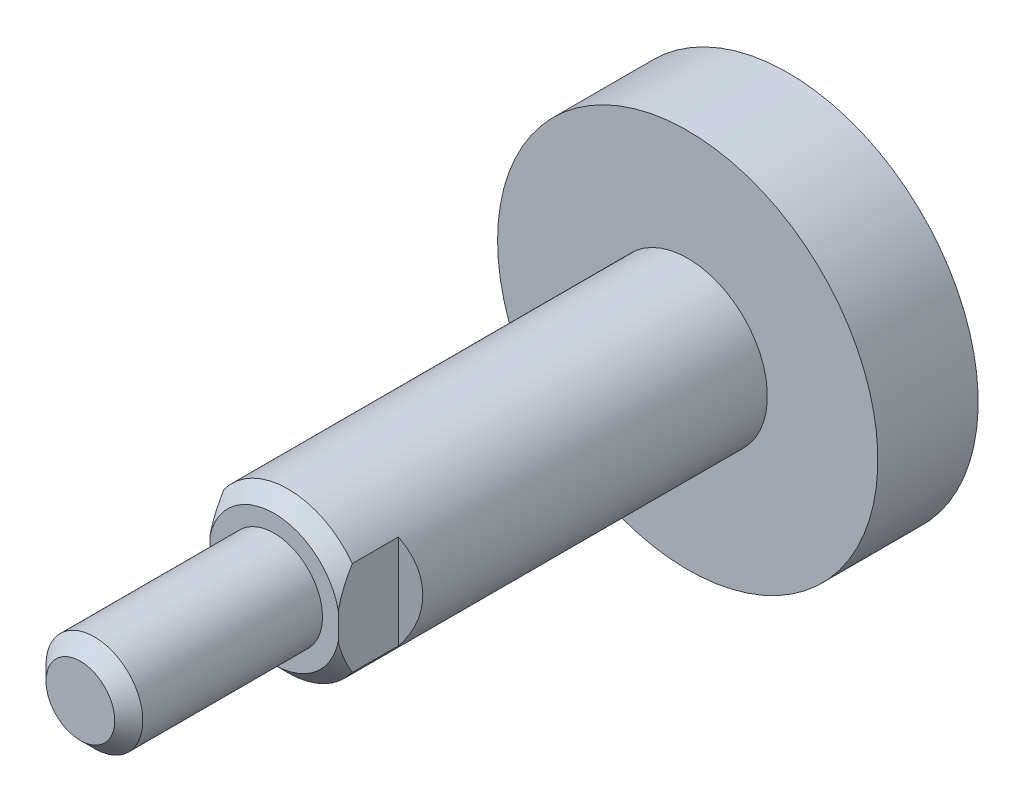
ISO-10303-21;
HEADER;
FILE_DESCRIPTION(('STEP AP214'),'2;1');
FILE_NAME('part.step','',(''),(''),'','','');
FILE_SCHEMA(('AUTOMOTIVE_DESIGN { 1 0 10303 214 1 1 1 1 }'));
ENDSEC;
DATA;
#1=APPLICATION_CONTEXT('core data for automotive mechanical design processes');
#2=APPLICATION_PROTOCOL_DEFINITION('international standard','automotive_design',2000,#1);
#3=PRODUCT_CONTEXT('',#1,'mechanical');
#4=PRODUCT('Part','Part','',(#3));
#5=PRODUCT_RELATED_PRODUCT_CATEGORY('part','',(#4));
#6=PRODUCT_DEFINITION_FORMATION('','',#4);
#7=PRODUCT_DEFINITION_CONTEXT('part definition',#1,'design');
#8=PRODUCT_DEFINITION('design','',#6,#7);
#9=PRODUCT_DEFINITION_SHAPE('','',#8);
#10=(LENGTH_UNIT() NAMED_UNIT(*) SI_UNIT(.MILLI.,.METRE.));
#11=(NAMED_UNIT(*) PLANE_ANGLE_UNIT() SI_UNIT($,.RADIAN.));
#12=(NAMED_UNIT(*) SI_UNIT($,.STERADIAN.) SOLID_ANGLE_UNIT());
#13=UNCERTAINTY_MEASURE_WITH_UNIT(LENGTH_MEASURE(1.E-05),#10,'distance_accuracy_value','');
#14=(GEOMETRIC_REPRESENTATION_CONTEXT(3) GLOBAL_UNCERTAINTY_ASSIGNED_CONTEXT((#13)) GLOBAL_UNIT_ASSIGNED_CONTEXT((#10,
#11,#12)) REPRESENTATION_CONTEXT('',''));
#15=CARTESIAN_POINT('',(0.,0.,0.));
#16=DIRECTION('',(0.,0.,1.));
#17=DIRECTION('',(1.,0.,0.));
#18=AXIS2_PLACEMENT_3D('',#15,#16,#17);
#19=CARTESIAN_POINT('',(0.,0.,35.266));
#20=DIRECTION('',(0.,0.,1.));
#21=DIRECTION('',(1.,0.,0.));
#22=AXIS2_PLACEMENT_3D('',#19,#20,#21);
#23=PLANE('',#22);
#24=CARTESIAN_POINT('',(0.,0.,35.2659999999219));
#25=DIRECTION('',(0.,0.,-1.));
#26=DIRECTION('',(-1.,0.,0.));
#27=AXIS2_PLACEMENT_3D('',#24,#25,#26);
#28=CIRCLE('',#27,1.71299999999519);
#29=CARTESIAN_POINT('',(-1.71299999999519,0.,35.2659999999219));
#30=VERTEX_POINT('',#29);
#31=EDGE_CURVE('E19',#30,#30,#28,.T.);
#32=ORIENTED_EDGE('',*,*,#31,.F.);
#33=EDGE_LOOP('',(#32));
#34=FACE_BOUND('',#33,.T.);
#35=ADVANCED_FACE('F16',(#34),#23,.T.);
#36=CARTESIAN_POINT('',(0.,0.,34.5659999999839));
#37=DIRECTION('',(0.,0.,-1.));
#38=DIRECTION('',(-1.,0.,0.));
#39=AXIS2_PLACEMENT_3D('',#36,#37,#38);
#40=CONICAL_SURFACE('',#39,2.41299999993316,0.785398163397448);
#41=ORIENTED_EDGE('',*,*,#31,.T.);
#42=EDGE_LOOP('',(#41));
#43=FACE_BOUND('',#42,.T.);
#44=CARTESIAN_POINT('',(0.,0.,34.566));
#45=DIRECTION('',(0.,0.,-1.));
#46=DIRECTION('',(-1.,0.,0.));
#47=AXIS2_PLACEMENT_3D('',#44,#45,#46);
#48=CIRCLE('',#47,2.413);
#49=CARTESIAN_POINT('',(-2.413,0.,34.566));
#50=VERTEX_POINT('',#49);
#51=EDGE_CURVE('E71',#50,#50,#48,.T.);
#52=ORIENTED_EDGE('',*,*,#51,.F.);
#53=EDGE_LOOP('',(#52));
#54=FACE_BOUND('',#53,.T.);
#55=ADVANCED_FACE('F196',(#43,#54),#40,.T.);
#56=CARTESIAN_POINT('',(0.,0.,35.266));
#57=DIRECTION('',(0.,0.,-1.));
#58=DIRECTION('',(-1.,0.,0.));
#59=AXIS2_PLACEMENT_3D('',#56,#57,#58);
#60=CYLINDRICAL_SURFACE('',#59,2.413);
#61=ORIENTED_EDGE('',*,*,#51,.T.);
#62=EDGE_LOOP('',(#61));
#63=FACE_BOUND('',#62,.T.);
#64=CARTESIAN_POINT('',(0.,0.,25.614));
#65=DIRECTION('',(0.,0.,-1.));
#66=DIRECTION('',(-1.,0.,0.));
#67=AXIS2_PLACEMENT_3D('',#64,#65,#66);
#68=CIRCLE('',#67,2.413);
#69=CARTESIAN_POINT('',(-2.413,0.,25.614));
#70=VERTEX_POINT('',#69);
#71=EDGE_CURVE('E70',#70,#70,#68,.F.);
#72=ORIENTED_EDGE('',*,*,#71,.T.);
#73=EDGE_LOOP('',(#72));
#74=FACE_BOUND('',#73,.T.);
#75=ADVANCED_FACE('F204',(#63,#74),#60,.T.);
#76=CARTESIAN_POINT('',(0.,0.,25.614));
#77=DIRECTION('',(0.,0.,-1.));
#78=DIRECTION('',(0.,1.,0.));
#79=AXIS2_PLACEMENT_3D('',#76,#77,#78);
#80=PLANE('',#79);
#81=ORIENTED_EDGE('',*,*,#71,.F.);
#82=EDGE_LOOP('',(#81));
#83=FACE_BOUND('',#82,.T.);
#84=DIRECTION('',(0.,1.,0.));
#85=VECTOR('',#84,1.);
#86=CARTESIAN_POINT('',(3.2,0.,25.614));
#87=LINE('',#86,#85);
#88=CARTESIAN_POINT('',(3.2,0.668102537170797,25.6139999999809));
#89=VERTEX_POINT('',#88);
#90=CARTESIAN_POINT('',(3.2,-0.668102537170798,25.6139999999809));
#91=VERTEX_POINT('',#90);
#92=EDGE_CURVE('E58',#89,#91,#87,.F.);
#93=ORIENTED_EDGE('',*,*,#92,.F.);
#94=CARTESIAN_POINT('',(0.,0.,25.6139999999618));
#95=DIRECTION('',(0.,0.,-1.));
#96=DIRECTION('',(0.,1.,0.));
#97=AXIS2_PLACEMENT_3D('',#94,#95,#96);
#98=CIRCLE('',#97,3.26900000004571);
#99=CARTESIAN_POINT('',(-3.2,0.668102537155263,25.6139999999841));
#100=VERTEX_POINT('',#99);
#101=EDGE_CURVE('E91',#100,#89,#98,.T.);
#102=ORIENTED_EDGE('',*,*,#101,.F.);
#103=DIRECTION('',(0.,1.,0.));
#104=VECTOR('',#103,1.);
#105=CARTESIAN_POINT('',(-3.2,-9.475,25.614));
#106=LINE('',#105,#104);
#107=CARTESIAN_POINT('',(-3.2,-0.668102537154732,25.6139999999842));
#108=VERTEX_POINT('',#107);
#109=EDGE_CURVE('E77',#100,#108,#106,.F.);
#110=ORIENTED_EDGE('',*,*,#109,.T.);
#111=CARTESIAN_POINT('',(0.,0.,25.6139999999618));
#112=DIRECTION('',(0.,0.,-1.));
#113=DIRECTION('',(0.,1.,0.));
#114=AXIS2_PLACEMENT_3D('',#111,#112,#113);
#115=CIRCLE('',#114,3.26900000004571);
#116=EDGE_CURVE('E75',#91,#108,#115,.T.);
#117=ORIENTED_EDGE('',*,*,#116,.F.);
#118=EDGE_LOOP('',(#93,#102,#110,#117));
#119=FACE_BOUND('',#118,.T.);
#120=ADVANCED_FACE('F76',(#83,#119),#80,.F.);
#121=CARTESIAN_POINT('',(0.,0.,24.9140000000807));
#122=DIRECTION('',(0.,0.,-1.));
#123=DIRECTION('',(0.,1.,0.));
#124=AXIS2_PLACEMENT_3D('',#121,#122,#123);
#125=CONICAL_SURFACE('',#124,3.96899999998368,0.785398163438051);
#126=CARTESIAN_POINT('',(-3.20000000000324,-0.668102537045559,25.6140000000079));
#127=CARTESIAN_POINT('',(-3.20000000000116,-0.791923989307162,25.5887118948215));
#128=CARTESIAN_POINT('',(-3.20000000000031,-0.914214432197644,25.5569533814339));
#129=CARTESIAN_POINT('',(-3.19999999999969,-1.15522323067472,25.482786734809));
#130=CARTESIAN_POINT('',(-3.19999999999992,-1.27394966585461,25.440405109426));
#131=CARTESIAN_POINT('',(-3.20000000000008,-1.50692397331803,25.3475394481742));
#132=CARTESIAN_POINT('',(-3.20000000000002,-1.62120166838874,25.2971285477279));
#133=CARTESIAN_POINT('',(-3.19999999999998,-1.8466563464418,25.1897204575799));
#134=CARTESIAN_POINT('',(-3.2,-1.95783200288132,25.1327205021669));
#135=CARTESIAN_POINT('',(-3.2,-2.1147772258552,25.047544782855));
#136=CARTESIAN_POINT('',(-3.2,-2.161701362435,25.021462011141));
#137=CARTESIAN_POINT('',(-3.2,-2.25515024754835,24.9683835316909));
#138=CARTESIAN_POINT('',(-3.2,-2.30167405357722,24.9413861634868));
#139=CARTESIAN_POINT('',(-3.2,-2.34796954838271,24.9140000000477));
#140=B_SPLINE_CURVE_WITH_KNOTS('',3,(#126,#127,#128,#129,#130,#131,#132,#133,#134,#135,#136,
#137,#138,#139),.UNSPECIFIED.,.F.,.F.,(4,2,2,2,2,2,4),(0.,0.378663318923574,0.756391005243895,
1.13085654278463,1.50547983437227,1.66653163363144,1.82789340191547),.UNSPECIFIED.);
#141=CARTESIAN_POINT('',(-3.2,-2.3479695483686,24.9140000000238));
#142=VERTEX_POINT('',#141);
#143=EDGE_CURVE('E116',#108,#142,#140,.T.);
#144=ORIENTED_EDGE('',*,*,#143,.T.);
#145=CARTESIAN_POINT('',(0.,0.,24.914));
#146=DIRECTION('',(0.,0.,-1.));
#147=DIRECTION('',(-1.,0.,0.));
#148=AXIS2_PLACEMENT_3D('',#145,#146,#147);
#149=CIRCLE('',#148,3.969);
#150=CARTESIAN_POINT('',(3.2,-2.3479695483686,24.9140000000238));
#151=VERTEX_POINT('',#150);
#152=EDGE_CURVE('E85',#151,#142,#149,.T.);
#153=ORIENTED_EDGE('',*,*,#152,.F.);
#154=CARTESIAN_POINT('',(3.2,-2.34796954838271,24.9140000000477));
#155=CARTESIAN_POINT('',(3.2,-2.28227540638902,24.9528576848915));
#156=CARTESIAN_POINT('',(3.2,-2.21612013329714,24.9909397042438));
#157=CARTESIAN_POINT('',(3.2,-2.08277615458881,25.065293160087));
#158=CARTESIAN_POINT('',(3.2,-2.01558715530726,25.1015640691656));
#159=CARTESIAN_POINT('',(3.2,-1.81330543751406,25.2067462963586));
#160=CARTESIAN_POINT('',(3.2,-1.6765834937986,25.2725768397312));
#161=CARTESIAN_POINT('',(3.2,-1.39788707534561,25.3932563066866));
#162=CARTESIAN_POINT('',(3.2,-1.25590184064602,25.4480810761872));
#163=CARTESIAN_POINT('',(3.2,-0.966123687795267,25.5431571719073));
#164=CARTESIAN_POINT('',(3.2,-0.81829778980787,25.5833066541209));
#165=CARTESIAN_POINT('',(3.2,-0.668102537044839,25.6140000000067));
#166=B_SPLINE_CURVE_WITH_KNOTS('',3,(#154,#155,#156,#157,#158,#159,#160,#161,#162,#163,#164,
#165),.UNSPECIFIED.,.F.,.F.,(4,2,2,2,2,4),(0.,0.228972156487963,0.458010607517393,
0.91289148643811,1.36876002116686,1.82773469580556),.UNSPECIFIED.);
#167=EDGE_CURVE('E63',#151,#91,#166,.T.);
#168=ORIENTED_EDGE('',*,*,#167,.T.);
#169=ORIENTED_EDGE('',*,*,#116,.T.);
#170=EDGE_LOOP('',(#144,#153,#168,#169));
#171=FACE_BOUND('',#170,.T.);
#172=ADVANCED_FACE('F84',(#171),#125,.T.);
#173=CARTESIAN_POINT('',(3.2,-9.475,22.614));
#174=DIRECTION('',(-0.500000000000005,0.,-0.866025403784436));
#175=DIRECTION('',(-0.866025403784436,0.,0.500000000000005));
#176=AXIS2_PLACEMENT_3D('',#173,#174,#175);
#177=PLANE('',#176);
#178=CARTESIAN_POINT('',(0.,0.,24.4615208614068));
#179=DIRECTION('',(-0.500000000000005,0.,-0.866025403784436));
#180=DIRECTION('',(0.866025403784436,0.,-0.500000000000005));
#181=AXIS2_PLACEMENT_3D('',#178,#179,#180);
#182=ELLIPSE('',#181,4.58300643682726,3.969);
#183=CARTESIAN_POINT('',(3.2,2.34796954835449,22.614));
#184=VERTEX_POINT('',#183);
#185=CARTESIAN_POINT('',(3.2,-2.34796954835449,22.614));
#186=VERTEX_POINT('',#185);
#187=EDGE_CURVE('E175',#184,#186,#182,.T.);
#188=ORIENTED_EDGE('',*,*,#187,.F.);
#189=DIRECTION('',(0.,1.,0.));
#190=VECTOR('',#189,1.);
#191=CARTESIAN_POINT('',(3.2,-9.475,22.614));
#192=LINE('',#191,#190);
#193=EDGE_CURVE('E86',#184,#186,#192,.F.);
#194=ORIENTED_EDGE('',*,*,#193,.T.);
#195=EDGE_LOOP('',(#188,#194));
#196=FACE_BOUND('',#195,.T.);
#197=ADVANCED_FACE('F111',(#196),#177,.F.);
#198=CARTESIAN_POINT('',(-3.2,-9.475,22.614));
#199=DIRECTION('',(0.500000000000004,0.,-0.866025403784436));
#200=DIRECTION('',(-0.866025403784436,0.,-0.500000000000004));
#201=AXIS2_PLACEMENT_3D('',#198,#199,#200);
#202=PLANE('',#201);
#203=CARTESIAN_POINT('',(0.,0.,24.4615208614068));
#204=DIRECTION('',(0.500000000000004,0.,-0.866025403784436));
#205=DIRECTION('',(-0.866025403784436,0.,-0.500000000000004));
#206=AXIS2_PLACEMENT_3D('',#203,#204,#205);
#207=ELLIPSE('',#206,4.58300643682726,3.969);
#208=CARTESIAN_POINT('',(-3.2,-2.34796954835449,22.614));
#209=VERTEX_POINT('',#208);
#210=CARTESIAN_POINT('',(-3.2,2.34796954835449,22.614));
#211=VERTEX_POINT('',#210);
#212=EDGE_CURVE('E172',#209,#211,#207,.T.);
#213=ORIENTED_EDGE('',*,*,#212,.F.);
#214=DIRECTION('',(0.,1.,0.));
#215=VECTOR('',#214,1.);
#216=CARTESIAN_POINT('',(-3.2,-9.475,22.614));
#217=LINE('',#216,#215);
#218=EDGE_CURVE('E81',#209,#211,#217,.T.);
#219=ORIENTED_EDGE('',*,*,#218,.T.);
#220=EDGE_LOOP('',(#213,#219));
#221=FACE_BOUND('',#220,.T.);
#222=ADVANCED_FACE('F129',(#221),#202,.F.);
#223=CARTESIAN_POINT('',(-3.2,-9.475,25.614));
#224=DIRECTION('',(1.,0.,0.));
#225=DIRECTION('',(0.,0.,-1.));
#226=AXIS2_PLACEMENT_3D('',#223,#224,#225);
#227=PLANE('',#226);
#228=ORIENTED_EDGE('',*,*,#143,.F.);
#229=ORIENTED_EDGE('',*,*,#109,.F.);
#230=CARTESIAN_POINT('',(-3.19999999998987,2.34796954838807,24.9140000000384));
#231=CARTESIAN_POINT('',(-3.19999999999627,2.28227540639574,24.9528576848853));
#232=CARTESIAN_POINT('',(-3.19999999999898,2.21612013330425,24.9909397042391));
#233=CARTESIAN_POINT('',(-3.20000000000102,2.08277615459583,25.0652931600838));
#234=CARTESIAN_POINT('',(-3.20000000000036,2.01558715531381,25.1015640691624));
#235=CARTESIAN_POINT('',(-3.19999999999929,1.81330543751945,25.2067462963555));
#236=CARTESIAN_POINT('',(-3.1999999999998,1.67658349380355,25.2725768397288));
#237=CARTESIAN_POINT('',(-3.2000000000002,1.39788707534955,25.3932563066852));
#238=CARTESIAN_POINT('',(-3.2000000000001,1.2559018406494,25.4480810761861));
#239=CARTESIAN_POINT('',(-3.1999999999999,0.966123687797418,25.5431571719066));
#240=CARTESIAN_POINT('',(-3.19999999999979,0.818297789809342,25.5833066541205));
#241=CARTESIAN_POINT('',(-3.2,0.668102537045687,25.6140000000065));
#242=B_SPLINE_CURVE_WITH_KNOTS('',3,(#230,#231,#232,#233,#234,#235,#236,#237,#238,#239,#240,
#241),.UNSPECIFIED.,.F.,.F.,(4,2,2,2,2,4),(0.,0.228972156489184,0.458010607519769,
0.912891486442607,1.3687600211732,1.82773469581398),.UNSPECIFIED.);
#243=CARTESIAN_POINT('',(-3.2,2.34796954835449,24.9140000000322));
#244=VERTEX_POINT('',#243);
#245=EDGE_CURVE('E121',#244,#100,#242,.T.);
#246=ORIENTED_EDGE('',*,*,#245,.F.);
#247=DIRECTION('',(0.,0.,-1.));
#248=VECTOR('',#247,1.);
#249=CARTESIAN_POINT('',(-3.2,2.34796954835449,36.8400272581176));
#250=LINE('',#249,#248);
#251=EDGE_CURVE('E174',#211,#244,#250,.F.);
#252=ORIENTED_EDGE('',*,*,#251,.F.);
#253=ORIENTED_EDGE('',*,*,#218,.F.);
#254=DIRECTION('',(0.,0.,-1.));
#255=VECTOR('',#254,1.);
#256=CARTESIAN_POINT('',(-3.2,-2.34796954835449,36.8400272581176));
#257=LINE('',#256,#255);
#258=EDGE_CURVE('E177',#142,#209,#257,.T.);
#259=ORIENTED_EDGE('',*,*,#258,.F.);
#260=EDGE_LOOP('',(#228,#229,#246,#252,#253,#259));
#261=FACE_BOUND('',#260,.T.);
#262=ADVANCED_FACE('F125',(#261),#227,.F.);
#263=CARTESIAN_POINT('',(0.,0.,24.9140000000807));
#264=DIRECTION('',(0.,0.,-1.));
#265=DIRECTION('',(0.,1.,0.));
#266=AXIS2_PLACEMENT_3D('',#263,#264,#265);
#267=CONICAL_SURFACE('',#266,3.96899999998368,0.785398163438051);
#268=ORIENTED_EDGE('',*,*,#245,.T.);
#269=ORIENTED_EDGE('',*,*,#101,.T.);
#270=CARTESIAN_POINT('',(3.20000000000325,0.668102537045564,25.6140000000079));
#271=CARTESIAN_POINT('',(3.20000000000117,0.791923989307168,25.5887118948215));
#272=CARTESIAN_POINT('',(3.20000000000031,0.914214432197651,25.5569533814339));
#273=CARTESIAN_POINT('',(3.19999999999969,1.15522323067473,25.482786734809));
#274=CARTESIAN_POINT('',(3.19999999999992,1.27394966585462,25.440405109426));
#275=CARTESIAN_POINT('',(3.20000000000008,1.50692397331804,25.3475394481742));
#276=CARTESIAN_POINT('',(3.20000000000003,1.62120166838875,25.2971285477279));
#277=CARTESIAN_POINT('',(3.19999999999998,1.84665634644181,25.1897204575799));
#278=CARTESIAN_POINT('',(3.2,1.95783200288133,25.1327205021669));
#279=CARTESIAN_POINT('',(3.20000000000001,2.11477722585521,25.0475447828549));
#280=CARTESIAN_POINT('',(3.2,2.161701362435,25.021462011141));
#281=CARTESIAN_POINT('',(3.2,2.25515024754835,24.9683835316909));
#282=CARTESIAN_POINT('',(3.2,2.30167405357722,24.9413861634868));
#283=CARTESIAN_POINT('',(3.2,2.34796954838271,24.9140000000477));
#284=B_SPLINE_CURVE_WITH_KNOTS('',3,(#270,#271,#272,#273,#274,#275,#276,#277,#278,#279,#280,
#281,#282,#283),.UNSPECIFIED.,.F.,.F.,(4,2,2,2,2,2,4),(0.,0.378663318923575,0.756391005243901,
1.13085654278463,1.50547983437227,1.66653163363144,1.82789340191546),.UNSPECIFIED.);
#285=CARTESIAN_POINT('',(3.2,2.3479695483686,24.9140000000238));
#286=VERTEX_POINT('',#285);
#287=EDGE_CURVE('E66',#89,#286,#284,.T.);
#288=ORIENTED_EDGE('',*,*,#287,.T.);
#289=CARTESIAN_POINT('',(0.,0.,24.914));
#290=DIRECTION('',(0.,0.,-1.));
#291=DIRECTION('',(-1.,0.,0.));
#292=AXIS2_PLACEMENT_3D('',#289,#290,#291);
#293=CIRCLE('',#292,3.969);
#294=EDGE_CURVE('E34',#244,#286,#293,.T.);
#295=ORIENTED_EDGE('',*,*,#294,.F.);
#296=EDGE_LOOP('',(#268,#269,#288,#295));
#297=FACE_BOUND('',#296,.T.);
#298=ADVANCED_FACE('F128',(#297),#267,.T.);
#299=CARTESIAN_POINT('',(3.2,-9.475,25.614));
#300=DIRECTION('',(-1.,0.,0.));
#301=DIRECTION('',(0.,0.,1.));
#302=AXIS2_PLACEMENT_3D('',#299,#300,#301);
#303=PLANE('',#302);
#304=ORIENTED_EDGE('',*,*,#287,.F.);
#305=ORIENTED_EDGE('',*,*,#92,.T.);
#306=ORIENTED_EDGE('',*,*,#167,.F.);
#307=DIRECTION('',(0.,0.,-1.));
#308=VECTOR('',#307,1.);
#309=CARTESIAN_POINT('',(3.20000000000001,-2.34796954835449,36.8400272581176));
#310=LINE('',#309,#308);
#311=EDGE_CURVE('E88',#186,#151,#310,.F.);
#312=ORIENTED_EDGE('',*,*,#311,.F.);
#313=ORIENTED_EDGE('',*,*,#193,.F.);
#314=DIRECTION('',(0.,0.,-1.));
#315=VECTOR('',#314,1.);
#316=CARTESIAN_POINT('',(3.2,2.34796954835449,36.8400272581176));
#317=LINE('',#316,#315);
#318=EDGE_CURVE('E166',#286,#184,#317,.T.);
#319=ORIENTED_EDGE('',*,*,#318,.F.);
#320=EDGE_LOOP('',(#304,#305,#306,#312,#313,#319));
#321=FACE_BOUND('',#320,.T.);
#322=ADVANCED_FACE('F60',(#321),#303,.F.);
#323=CARTESIAN_POINT('',(0.,0.,36.8400272581176));
#324=DIRECTION('',(0.,0.,-1.));
#325=DIRECTION('',(-1.,0.,0.));
#326=AXIS2_PLACEMENT_3D('',#323,#324,#325);
#327=CYLINDRICAL_SURFACE('',#326,3.969);
#328=CARTESIAN_POINT('',(0.,0.,5.));
#329=DIRECTION('',(0.,0.,-1.));
#330=DIRECTION('',(-1.,0.,0.));
#331=AXIS2_PLACEMENT_3D('',#328,#329,#330);
#332=CIRCLE('',#331,3.969);
#333=CARTESIAN_POINT('',(-3.969,0.,5.));
#334=VERTEX_POINT('',#333);
#335=EDGE_CURVE('E164',#334,#334,#332,.T.);
#336=ORIENTED_EDGE('',*,*,#335,.F.);
#337=EDGE_LOOP('',(#336));
#338=FACE_BOUND('',#337,.T.);
#339=ORIENTED_EDGE('',*,*,#294,.T.);
#340=ORIENTED_EDGE('',*,*,#318,.T.);
#341=ORIENTED_EDGE('',*,*,#187,.T.);
#342=ORIENTED_EDGE('',*,*,#311,.T.);
#343=ORIENTED_EDGE('',*,*,#152,.T.);
#344=ORIENTED_EDGE('',*,*,#258,.T.);
#345=ORIENTED_EDGE('',*,*,#212,.T.);
#346=ORIENTED_EDGE('',*,*,#251,.T.);
#347=EDGE_LOOP('',(#339,#340,#341,#342,#343,#344,#345,#346));
#348=FACE_BOUND('',#347,.T.);
#349=ADVANCED_FACE('F155',(#338,#348),#327,.T.);
#350=CARTESIAN_POINT('',(0.,0.,5.));
#351=DIRECTION('',(0.,0.,1.));
#352=DIRECTION('',(1.,0.,0.));
#353=AXIS2_PLACEMENT_3D('',#350,#351,#352);
#354=PLANE('',#353);
#355=CARTESIAN_POINT('',(0.,0.,5.));
#356=DIRECTION('',(0.,0.,-1.));
#357=DIRECTION('',(-1.,0.,0.));
#358=AXIS2_PLACEMENT_3D('',#355,#356,#357);
#359=CIRCLE('',#358,9.475);
#360=CARTESIAN_POINT('',(-9.475,0.,5.));
#361=VERTEX_POINT('',#360);
#362=EDGE_CURVE('E25',#361,#361,#359,.T.);
#363=ORIENTED_EDGE('',*,*,#362,.F.);
#364=EDGE_LOOP('',(#363));
#365=FACE_BOUND('',#364,.T.);
#366=ORIENTED_EDGE('',*,*,#335,.T.);
#367=EDGE_LOOP('',(#366));
#368=FACE_BOUND('',#367,.T.);
#369=ADVANCED_FACE('F149',(#365,#368),#354,.T.);
#370=CARTESIAN_POINT('',(0.,0.,5.));
#371=DIRECTION('',(0.,0.,-1.));
#372=DIRECTION('',(-1.,0.,0.));
#373=AXIS2_PLACEMENT_3D('',#370,#371,#372);
#374=CYLINDRICAL_SURFACE('',#373,9.475);
#375=ORIENTED_EDGE('',*,*,#362,.T.);
#376=EDGE_LOOP('',(#375));
#377=FACE_BOUND('',#376,.T.);
#378=CARTESIAN_POINT('',(0.,0.,0.));
#379=DIRECTION('',(0.,0.,-1.));
#380=DIRECTION('',(-1.,0.,0.));
#381=AXIS2_PLACEMENT_3D('',#378,#379,#380);
#382=CIRCLE('',#381,9.475);
#383=CARTESIAN_POINT('',(-9.475,0.,0.));
#384=VERTEX_POINT('',#383);
#385=EDGE_CURVE('E11',#384,#384,#382,.F.);
#386=ORIENTED_EDGE('',*,*,#385,.T.);
#387=EDGE_LOOP('',(#386));
#388=FACE_BOUND('',#387,.T.);
#389=ADVANCED_FACE('F143',(#377,#388),#374,.T.);
#390=CARTESIAN_POINT('',(0.,0.,0.));
#391=DIRECTION('',(0.,0.,1.));
#392=DIRECTION('',(1.,0.,0.));
#393=AXIS2_PLACEMENT_3D('',#390,#391,#392);
#394=PLANE('',#393);
#395=ORIENTED_EDGE('',*,*,#385,.F.);
#396=EDGE_LOOP('',(#395));
#397=FACE_BOUND('',#396,.T.);
#398=ADVANCED_FACE('F141',(#397),#394,.F.);
#399=CLOSED_SHELL('',(#35,#55,#75,#120,#172,#197,#222,#262,#298,#322,#349,#369,#389,#398));
#400=MANIFOLD_SOLID_BREP('B1',#399);
#401=ADVANCED_BREP_SHAPE_REPRESENTATION('',(#18,#400),#14);
#402=SHAPE_DEFINITION_REPRESENTATION(#9,#401);
ENDSEC;
END-ISO-10303-21;
